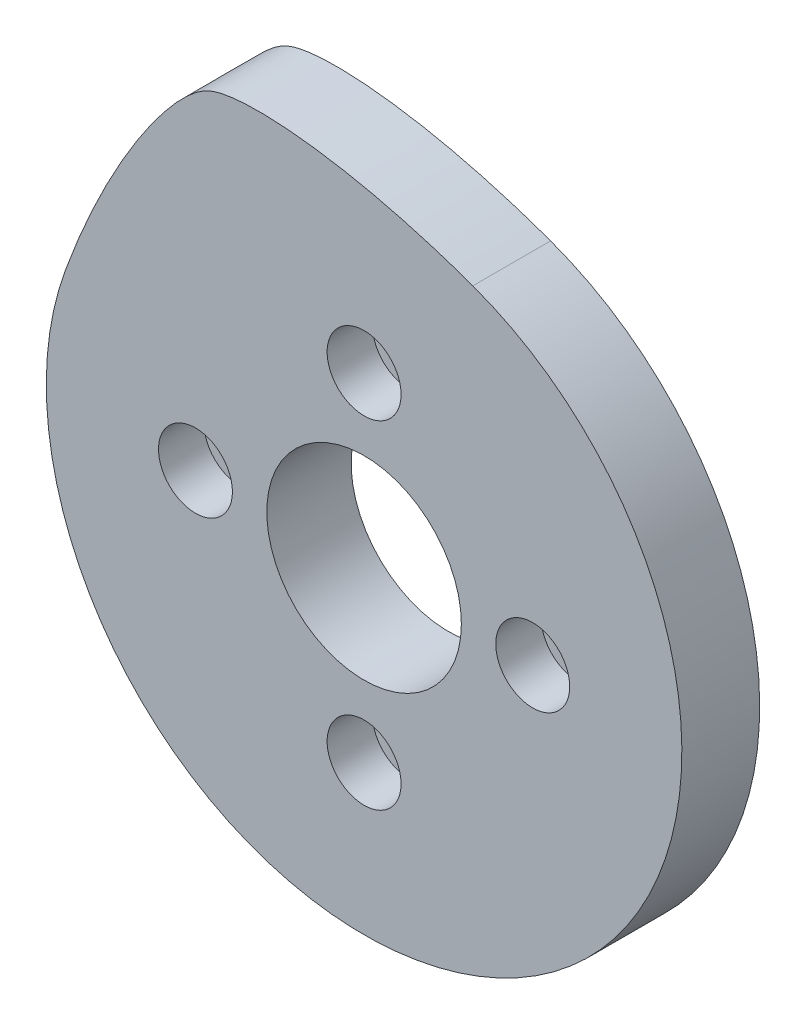
ISO-10303-21;
HEADER;
FILE_DESCRIPTION(('STEP AP214'),'2;1');
FILE_NAME('part.step','',(''),(''),'','','');
FILE_SCHEMA(('AUTOMOTIVE_DESIGN { 1 0 10303 214 1 1 1 1 }'));
ENDSEC;
DATA;
#1=APPLICATION_CONTEXT('core data for automotive mechanical design processes');
#2=APPLICATION_PROTOCOL_DEFINITION('international standard','automotive_design',2000,#1);
#3=PRODUCT_CONTEXT('',#1,'mechanical');
#4=PRODUCT('Part','Part','',(#3));
#5=PRODUCT_RELATED_PRODUCT_CATEGORY('part','',(#4));
#6=PRODUCT_DEFINITION_FORMATION('','',#4);
#7=PRODUCT_DEFINITION_CONTEXT('part definition',#1,'design');
#8=PRODUCT_DEFINITION('design','',#6,#7);
#9=PRODUCT_DEFINITION_SHAPE('','',#8);
#10=(LENGTH_UNIT() NAMED_UNIT(*) SI_UNIT(.MILLI.,.METRE.));
#11=(NAMED_UNIT(*) PLANE_ANGLE_UNIT() SI_UNIT($,.RADIAN.));
#12=(NAMED_UNIT(*) SI_UNIT($,.STERADIAN.) SOLID_ANGLE_UNIT());
#13=UNCERTAINTY_MEASURE_WITH_UNIT(LENGTH_MEASURE(1.E-05),#10,'distance_accuracy_value','');
#14=(GEOMETRIC_REPRESENTATION_CONTEXT(3) GLOBAL_UNCERTAINTY_ASSIGNED_CONTEXT((#13)) GLOBAL_UNIT_ASSIGNED_CONTEXT((#10,
#11,#12)) REPRESENTATION_CONTEXT('',''));
#15=CARTESIAN_POINT('',(0.,0.,0.));
#16=DIRECTION('',(0.,0.,1.));
#17=DIRECTION('',(1.,0.,0.));
#18=AXIS2_PLACEMENT_3D('',#15,#16,#17);
#19=CARTESIAN_POINT('',(-13.,0.,6.));
#20=DIRECTION('',(0.,0.,-1.));
#21=DIRECTION('',(-1.,0.,0.));
#22=AXIS2_PLACEMENT_3D('',#19,#20,#21);
#23=CYLINDRICAL_SURFACE('',#22,2.85);
#24=CARTESIAN_POINT('',(-13.,0.,2.5));
#25=DIRECTION('',(0.,0.,1.));
#26=DIRECTION('',(1.,0.,0.));
#27=AXIS2_PLACEMENT_3D('',#24,#25,#26);
#28=CIRCLE('',#27,2.85);
#29=CARTESIAN_POINT('',(-10.15,0.,2.5));
#30=VERTEX_POINT('',#29);
#31=EDGE_CURVE('E48',#30,#30,#28,.T.);
#32=ORIENTED_EDGE('',*,*,#31,.F.);
#33=EDGE_LOOP('',(#32));
#34=FACE_BOUND('',#33,.T.);
#35=CARTESIAN_POINT('',(-13.,0.,6.));
#36=DIRECTION('',(0.,0.,1.));
#37=DIRECTION('',(1.,0.,0.));
#38=AXIS2_PLACEMENT_3D('',#35,#36,#37);
#39=CIRCLE('',#38,2.85);
#40=CARTESIAN_POINT('',(-10.15,0.,6.));
#41=VERTEX_POINT('',#40);
#42=EDGE_CURVE('E104',#41,#41,#39,.T.);
#43=ORIENTED_EDGE('',*,*,#42,.T.);
#44=EDGE_LOOP('',(#43));
#45=FACE_BOUND('',#44,.T.);
#46=ADVANCED_FACE('F44',(#34,#45),#23,.F.);
#47=CARTESIAN_POINT('',(0.,13.,6.));
#48=DIRECTION('',(0.,0.,-1.));
#49=DIRECTION('',(-1.,0.,0.));
#50=AXIS2_PLACEMENT_3D('',#47,#48,#49);
#51=CYLINDRICAL_SURFACE('',#50,2.85);
#52=CARTESIAN_POINT('',(0.,13.,2.5));
#53=DIRECTION('',(0.,0.,1.));
#54=DIRECTION('',(1.,0.,0.));
#55=AXIS2_PLACEMENT_3D('',#52,#53,#54);
#56=CIRCLE('',#55,2.85);
#57=CARTESIAN_POINT('',(2.85000000000005,13.,2.5));
#58=VERTEX_POINT('',#57);
#59=EDGE_CURVE('E112',#58,#58,#56,.T.);
#60=ORIENTED_EDGE('',*,*,#59,.F.);
#61=EDGE_LOOP('',(#60));
#62=FACE_BOUND('',#61,.T.);
#63=CARTESIAN_POINT('',(0.,13.,6.));
#64=DIRECTION('',(0.,0.,1.));
#65=DIRECTION('',(1.,0.,0.));
#66=AXIS2_PLACEMENT_3D('',#63,#64,#65);
#67=CIRCLE('',#66,2.85);
#68=CARTESIAN_POINT('',(2.85000000000005,13.,6.));
#69=VERTEX_POINT('',#68);
#70=EDGE_CURVE('E101',#69,#69,#67,.T.);
#71=ORIENTED_EDGE('',*,*,#70,.T.);
#72=EDGE_LOOP('',(#71));
#73=FACE_BOUND('',#72,.T.);
#74=ADVANCED_FACE('F123',(#62,#73),#51,.F.);
#75=CARTESIAN_POINT('',(13.,0.,6.));
#76=DIRECTION('',(0.,0.,-1.));
#77=DIRECTION('',(-1.,0.,0.));
#78=AXIS2_PLACEMENT_3D('',#75,#76,#77);
#79=CYLINDRICAL_SURFACE('',#78,2.85);
#80=CARTESIAN_POINT('',(13.,0.,2.5));
#81=DIRECTION('',(0.,0.,1.));
#82=DIRECTION('',(1.,0.,0.));
#83=AXIS2_PLACEMENT_3D('',#80,#81,#82);
#84=CIRCLE('',#83,2.85);
#85=CARTESIAN_POINT('',(15.85,0.,2.5));
#86=VERTEX_POINT('',#85);
#87=EDGE_CURVE('E110',#86,#86,#84,.T.);
#88=ORIENTED_EDGE('',*,*,#87,.F.);
#89=EDGE_LOOP('',(#88));
#90=FACE_BOUND('',#89,.T.);
#91=CARTESIAN_POINT('',(13.,0.,6.));
#92=DIRECTION('',(0.,0.,1.));
#93=DIRECTION('',(1.,0.,0.));
#94=AXIS2_PLACEMENT_3D('',#91,#92,#93);
#95=CIRCLE('',#94,2.85);
#96=CARTESIAN_POINT('',(15.85,0.,6.));
#97=VERTEX_POINT('',#96);
#98=EDGE_CURVE('E98',#97,#97,#95,.T.);
#99=ORIENTED_EDGE('',*,*,#98,.T.);
#100=EDGE_LOOP('',(#99));
#101=FACE_BOUND('',#100,.T.);
#102=ADVANCED_FACE('F139',(#90,#101),#79,.F.);
#103=CARTESIAN_POINT('',(-1.36167772214882E-13,-13.,6.));
#104=DIRECTION('',(0.,0.,-1.));
#105=DIRECTION('',(-1.,0.,0.));
#106=AXIS2_PLACEMENT_3D('',#103,#104,#105);
#107=CYLINDRICAL_SURFACE('',#106,2.85);
#108=CARTESIAN_POINT('',(-1.36167772214882E-13,-13.,2.5));
#109=DIRECTION('',(0.,0.,1.));
#110=DIRECTION('',(1.,0.,0.));
#111=AXIS2_PLACEMENT_3D('',#108,#109,#110);
#112=CIRCLE('',#111,2.85);
#113=CARTESIAN_POINT('',(2.84999999999986,-13.,2.5));
#114=VERTEX_POINT('',#113);
#115=EDGE_CURVE('E107',#114,#114,#112,.T.);
#116=ORIENTED_EDGE('',*,*,#115,.F.);
#117=EDGE_LOOP('',(#116));
#118=FACE_BOUND('',#117,.T.);
#119=CARTESIAN_POINT('',(-1.36167772214882E-13,-13.,6.));
#120=DIRECTION('',(0.,0.,1.));
#121=DIRECTION('',(1.,0.,0.));
#122=AXIS2_PLACEMENT_3D('',#119,#120,#121);
#123=CIRCLE('',#122,2.85);
#124=CARTESIAN_POINT('',(2.84999999999986,-13.,6.));
#125=VERTEX_POINT('',#124);
#126=EDGE_CURVE('E75',#125,#125,#123,.T.);
#127=ORIENTED_EDGE('',*,*,#126,.T.);
#128=EDGE_LOOP('',(#127));
#129=FACE_BOUND('',#128,.T.);
#130=ADVANCED_FACE('F46',(#118,#129),#107,.F.);
#131=CARTESIAN_POINT('',(0.,0.,6.));
#132=DIRECTION('',(0.,0.,1.));
#133=DIRECTION('',(1.,0.,0.));
#134=AXIS2_PLACEMENT_3D('',#131,#132,#133);
#135=PLANE('',#134);
#136=CARTESIAN_POINT('',(0.,0.,6.));
#137=DIRECTION('',(0.,0.,1.));
#138=DIRECTION('',(1.,0.,0.));
#139=AXIS2_PLACEMENT_3D('',#136,#137,#138);
#140=CIRCLE('',#139,7.5);
#141=CARTESIAN_POINT('',(7.5,0.,6.));
#142=VERTEX_POINT('',#141);
#143=EDGE_CURVE('E221',#142,#142,#140,.T.);
#144=ORIENTED_EDGE('',*,*,#143,.F.);
#145=EDGE_LOOP('',(#144));
#146=FACE_BOUND('',#145,.T.);
#147=ORIENTED_EDGE('',*,*,#126,.F.);
#148=EDGE_LOOP('',(#147));
#149=FACE_BOUND('',#148,.T.);
#150=ORIENTED_EDGE('',*,*,#98,.F.);
#151=EDGE_LOOP('',(#150));
#152=FACE_BOUND('',#151,.T.);
#153=ORIENTED_EDGE('',*,*,#70,.F.);
#154=EDGE_LOOP('',(#153));
#155=FACE_BOUND('',#154,.T.);
#156=ORIENTED_EDGE('',*,*,#42,.F.);
#157=EDGE_LOOP('',(#156));
#158=FACE_BOUND('',#157,.T.);
#159=CARTESIAN_POINT('',(0.,0.,6.00000000000001));
#160=DIRECTION('',(0.,0.,1.));
#161=DIRECTION('',(1.,0.,0.));
#162=AXIS2_PLACEMENT_3D('',#159,#160,#161);
#163=CIRCLE('',#162,24.5);
#164=CARTESIAN_POINT('',(8.37949351147875,23.0224692092548,6.00000000000001));
#165=VERTEX_POINT('',#164);
#166=CARTESIAN_POINT('',(-23.0224692092548,8.37949351147867,6.00000000000001));
#167=VERTEX_POINT('',#166);
#168=EDGE_CURVE('E59',#165,#167,#163,.F.);
#169=ORIENTED_EDGE('',*,*,#168,.F.);
#170=CARTESIAN_POINT('',(-23.0224692092548,8.37949351147867,6.00000000000001));
#171=CARTESIAN_POINT('',(-19.9442879193239,16.8367270985519,6.00000000000001));
#172=CARTESIAN_POINT('',(-14.7236811956561,24.6247501376525,6.00000000000001));
#173=CARTESIAN_POINT('',(-9.3994531646,27.1074784422976,6.00000000000001));
#174=CARTESIAN_POINT('',(-0.0777400755944418,26.1006504991857,6.00000000000001));
#175=CARTESIAN_POINT('',(8.37949351147875,23.0224692092548,6.00000000000001));
#176=B_SPLINE_CURVE_WITH_KNOTS('',3,(#170,#171,#172,#173,#174,#175),.UNSPECIFIED.,.F.,.F.,(4,1,
1,4),(0.,0.45,0.55,1.),.UNSPECIFIED.);
#177=EDGE_CURVE('E72',#167,#165,#176,.T.);
#178=ORIENTED_EDGE('',*,*,#177,.F.);
#179=EDGE_LOOP('',(#169,#178));
#180=FACE_BOUND('',#179,.T.);
#181=ADVANCED_FACE('F73',(#146,#149,#152,#155,#158,#180),#135,.T.);
#182=CARTESIAN_POINT('',(0.,0.,0.));
#183=DIRECTION('',(0.,0.,1.));
#184=DIRECTION('',(1.,0.,0.));
#185=AXIS2_PLACEMENT_3D('',#182,#183,#184);
#186=PLANE('',#185);
#187=CARTESIAN_POINT('',(0.,0.,0.));
#188=DIRECTION('',(0.,0.,-1.));
#189=DIRECTION('',(-1.,0.,0.));
#190=AXIS2_PLACEMENT_3D('',#187,#188,#189);
#191=CIRCLE('',#190,21.);
#192=CARTESIAN_POINT('',(-21.,0.,0.));
#193=VERTEX_POINT('',#192);
#194=EDGE_CURVE('E12',#193,#193,#191,.T.);
#195=ORIENTED_EDGE('',*,*,#194,.F.);
#196=EDGE_LOOP('',(#195));
#197=FACE_BOUND('',#196,.T.);
#198=CARTESIAN_POINT('',(0.,0.,0.));
#199=DIRECTION('',(0.,0.,-1.));
#200=DIRECTION('',(-1.,0.,0.));
#201=AXIS2_PLACEMENT_3D('',#198,#199,#200);
#202=CIRCLE('',#201,24.5);
#203=CARTESIAN_POINT('',(8.37949351147875,23.0224692092548,0.));
#204=VERTEX_POINT('',#203);
#205=CARTESIAN_POINT('',(-23.0224692092548,8.37949351147867,0.));
#206=VERTEX_POINT('',#205);
#207=EDGE_CURVE('E81',#204,#206,#202,.T.);
#208=ORIENTED_EDGE('',*,*,#207,.T.);
#209=CARTESIAN_POINT('',(-23.0224692092548,8.37949351147867,0.));
#210=CARTESIAN_POINT('',(-19.9442879193239,16.8367270985519,0.));
#211=CARTESIAN_POINT('',(-14.7236811956561,24.6247501376525,0.));
#212=CARTESIAN_POINT('',(-9.3994531646,27.1074784422976,0.));
#213=CARTESIAN_POINT('',(-0.0777400755944418,26.1006504991857,0.));
#214=CARTESIAN_POINT('',(8.37949351147875,23.0224692092548,0.));
#215=B_SPLINE_CURVE_WITH_KNOTS('',3,(#209,#210,#211,#212,#213,#214),.UNSPECIFIED.,.F.,.F.,(4,1,
1,4),(0.,0.45,0.55,1.),.UNSPECIFIED.);
#216=EDGE_CURVE('E86',#206,#204,#215,.T.);
#217=ORIENTED_EDGE('',*,*,#216,.T.);
#218=EDGE_LOOP('',(#208,#217));
#219=FACE_BOUND('',#218,.T.);
#220=ADVANCED_FACE('F128',(#197,#219),#186,.F.);
#221=CARTESIAN_POINT('',(-23.0224692092548,8.37949351147867,77.1641189868336));
#222=CARTESIAN_POINT('',(-19.9442879193239,16.8367270985519,77.1641189868336));
#223=CARTESIAN_POINT('',(-14.7236811956561,24.6247501376525,77.1641189868336));
#224=CARTESIAN_POINT('',(-9.3994531646,27.1074784422976,77.1641189868336));
#225=CARTESIAN_POINT('',(-0.0777400755944418,26.1006504991857,77.1641189868336));
#226=CARTESIAN_POINT('',(8.37949351147875,23.0224692092548,77.1641189868336));
#227=B_SPLINE_CURVE_WITH_KNOTS('',3,(#221,#222,#223,#224,#225,#226),.UNSPECIFIED.,.F.,.F.,(4,1,
1,4),(0.,0.45,0.55,1.),.UNSPECIFIED.);
#228=DIRECTION('',(0.,0.,-1.));
#229=VECTOR('',#228,1.);
#230=SURFACE_OF_LINEAR_EXTRUSION('',#227,#229);
#231=DIRECTION('',(0.,0.,-1.));
#232=VECTOR('',#231,1.);
#233=CARTESIAN_POINT('',(-23.0224692092548,8.37949351147867,77.1641189868336));
#234=LINE('',#233,#232);
#235=EDGE_CURVE('E79',#167,#206,#234,.T.);
#236=ORIENTED_EDGE('',*,*,#235,.F.);
#237=ORIENTED_EDGE('',*,*,#177,.T.);
#238=DIRECTION('',(0.,0.,-1.));
#239=VECTOR('',#238,1.);
#240=CARTESIAN_POINT('',(8.37949351147875,23.0224692092548,77.1641189868336));
#241=LINE('',#240,#239);
#242=EDGE_CURVE('E66',#165,#204,#241,.T.);
#243=ORIENTED_EDGE('',*,*,#242,.T.);
#244=ORIENTED_EDGE('',*,*,#216,.F.);
#245=EDGE_LOOP('',(#236,#237,#243,#244));
#246=FACE_BOUND('',#245,.T.);
#247=ADVANCED_FACE('F84',(#246),#230,.T.);
#248=CARTESIAN_POINT('',(0.,0.,77.1641189868336));
#249=DIRECTION('',(0.,0.,-1.));
#250=DIRECTION('',(-1.,0.,0.));
#251=AXIS2_PLACEMENT_3D('',#248,#249,#250);
#252=CYLINDRICAL_SURFACE('',#251,24.5);
#253=ORIENTED_EDGE('',*,*,#242,.F.);
#254=ORIENTED_EDGE('',*,*,#168,.T.);
#255=ORIENTED_EDGE('',*,*,#235,.T.);
#256=ORIENTED_EDGE('',*,*,#207,.F.);
#257=EDGE_LOOP('',(#253,#254,#255,#256));
#258=FACE_BOUND('',#257,.T.);
#259=ADVANCED_FACE('F78',(#258),#252,.T.);
#260=CARTESIAN_POINT('',(13.,0.,14.0610173055266));
#261=DIRECTION('',(0.,0.,-1.));
#262=DIRECTION('',(-1.,0.,0.));
#263=AXIS2_PLACEMENT_3D('',#260,#261,#262);
#264=CYLINDRICAL_SURFACE('',#263,1.6);
#265=CARTESIAN_POINT('',(13.,0.,2.5));
#266=DIRECTION('',(0.,0.,1.));
#267=DIRECTION('',(1.,0.,0.));
#268=AXIS2_PLACEMENT_3D('',#265,#266,#267);
#269=CIRCLE('',#268,1.6);
#270=CARTESIAN_POINT('',(14.6,0.,2.5));
#271=VERTEX_POINT('',#270);
#272=EDGE_CURVE('E194',#271,#271,#269,.T.);
#273=ORIENTED_EDGE('',*,*,#272,.T.);
#274=EDGE_LOOP('',(#273));
#275=FACE_BOUND('',#274,.T.);
#276=CARTESIAN_POINT('',(13.,0.,-0.5));
#277=DIRECTION('',(0.,0.,-1.));
#278=DIRECTION('',(-1.,0.,0.));
#279=AXIS2_PLACEMENT_3D('',#276,#277,#278);
#280=CIRCLE('',#279,1.6);
#281=CARTESIAN_POINT('',(11.4,0.,-0.5));
#282=VERTEX_POINT('',#281);
#283=EDGE_CURVE('E208',#282,#282,#280,.T.);
#284=ORIENTED_EDGE('',*,*,#283,.T.);
#285=EDGE_LOOP('',(#284));
#286=FACE_BOUND('',#285,.T.);
#287=ADVANCED_FACE('F163',(#275,#286),#264,.F.);
#288=CARTESIAN_POINT('',(0.,0.,2.5));
#289=DIRECTION('',(0.,0.,1.));
#290=DIRECTION('',(1.,0.,0.));
#291=AXIS2_PLACEMENT_3D('',#288,#289,#290);
#292=PLANE('',#291);
#293=ORIENTED_EDGE('',*,*,#272,.F.);
#294=EDGE_LOOP('',(#293));
#295=FACE_BOUND('',#294,.T.);
#296=ORIENTED_EDGE('',*,*,#87,.T.);
#297=EDGE_LOOP('',(#296));
#298=FACE_BOUND('',#297,.T.);
#299=ADVANCED_FACE('F160',(#295,#298),#292,.T.);
#300=CARTESIAN_POINT('',(0.,13.,14.0610173055266));
#301=DIRECTION('',(0.,0.,-1.));
#302=DIRECTION('',(-1.,0.,0.));
#303=AXIS2_PLACEMENT_3D('',#300,#301,#302);
#304=CYLINDRICAL_SURFACE('',#303,1.6);
#305=CARTESIAN_POINT('',(0.,13.,2.5));
#306=DIRECTION('',(0.,0.,1.));
#307=DIRECTION('',(1.,0.,0.));
#308=AXIS2_PLACEMENT_3D('',#305,#306,#307);
#309=CIRCLE('',#308,1.6);
#310=CARTESIAN_POINT('',(1.60000000000005,13.,2.5));
#311=VERTEX_POINT('',#310);
#312=EDGE_CURVE('E197',#311,#311,#309,.T.);
#313=ORIENTED_EDGE('',*,*,#312,.T.);
#314=EDGE_LOOP('',(#313));
#315=FACE_BOUND('',#314,.T.);
#316=CARTESIAN_POINT('',(0.,13.,-0.5));
#317=DIRECTION('',(0.,0.,-1.));
#318=DIRECTION('',(-1.,0.,0.));
#319=AXIS2_PLACEMENT_3D('',#316,#317,#318);
#320=CIRCLE('',#319,1.6);
#321=CARTESIAN_POINT('',(-1.59999999999996,13.,-0.5));
#322=VERTEX_POINT('',#321);
#323=EDGE_CURVE('E217',#322,#322,#320,.T.);
#324=ORIENTED_EDGE('',*,*,#323,.T.);
#325=EDGE_LOOP('',(#324));
#326=FACE_BOUND('',#325,.T.);
#327=ADVANCED_FACE('F162',(#315,#326),#304,.F.);
#328=CARTESIAN_POINT('',(0.,0.,2.5));
#329=DIRECTION('',(0.,0.,1.));
#330=DIRECTION('',(1.,0.,0.));
#331=AXIS2_PLACEMENT_3D('',#328,#329,#330);
#332=PLANE('',#331);
#333=ORIENTED_EDGE('',*,*,#312,.F.);
#334=EDGE_LOOP('',(#333));
#335=FACE_BOUND('',#334,.T.);
#336=ORIENTED_EDGE('',*,*,#59,.T.);
#337=EDGE_LOOP('',(#336));
#338=FACE_BOUND('',#337,.T.);
#339=ADVANCED_FACE('F170',(#335,#338),#332,.T.);
#340=CARTESIAN_POINT('',(-13.,0.,14.0610173055266));
#341=DIRECTION('',(0.,0.,-1.));
#342=DIRECTION('',(-1.,0.,0.));
#343=AXIS2_PLACEMENT_3D('',#340,#341,#342);
#344=CYLINDRICAL_SURFACE('',#343,1.6);
#345=CARTESIAN_POINT('',(-13.,0.,2.5));
#346=DIRECTION('',(0.,0.,1.));
#347=DIRECTION('',(1.,0.,0.));
#348=AXIS2_PLACEMENT_3D('',#345,#346,#347);
#349=CIRCLE('',#348,1.6);
#350=CARTESIAN_POINT('',(-11.4,0.,2.5));
#351=VERTEX_POINT('',#350);
#352=EDGE_CURVE('E201',#351,#351,#349,.T.);
#353=ORIENTED_EDGE('',*,*,#352,.T.);
#354=EDGE_LOOP('',(#353));
#355=FACE_BOUND('',#354,.T.);
#356=CARTESIAN_POINT('',(-13.,0.,-0.5));
#357=DIRECTION('',(0.,0.,-1.));
#358=DIRECTION('',(-1.,0.,0.));
#359=AXIS2_PLACEMENT_3D('',#356,#357,#358);
#360=CIRCLE('',#359,1.6);
#361=CARTESIAN_POINT('',(-14.6,0.,-0.5));
#362=VERTEX_POINT('',#361);
#363=EDGE_CURVE('E214',#362,#362,#360,.T.);
#364=ORIENTED_EDGE('',*,*,#363,.T.);
#365=EDGE_LOOP('',(#364));
#366=FACE_BOUND('',#365,.T.);
#367=ADVANCED_FACE('F249',(#355,#366),#344,.F.);
#368=CARTESIAN_POINT('',(0.,0.,2.5));
#369=DIRECTION('',(0.,0.,1.));
#370=DIRECTION('',(1.,0.,0.));
#371=AXIS2_PLACEMENT_3D('',#368,#369,#370);
#372=PLANE('',#371);
#373=ORIENTED_EDGE('',*,*,#352,.F.);
#374=EDGE_LOOP('',(#373));
#375=FACE_BOUND('',#374,.T.);
#376=ORIENTED_EDGE('',*,*,#31,.T.);
#377=EDGE_LOOP('',(#376));
#378=FACE_BOUND('',#377,.T.);
#379=ADVANCED_FACE('F119',(#375,#378),#372,.T.);
#380=CARTESIAN_POINT('',(-1.36167772214882E-13,-13.,14.0610173055266));
#381=DIRECTION('',(0.,0.,-1.));
#382=DIRECTION('',(-1.,0.,0.));
#383=AXIS2_PLACEMENT_3D('',#380,#381,#382);
#384=CYLINDRICAL_SURFACE('',#383,1.6);
#385=CARTESIAN_POINT('',(-1.36167772214882E-13,-13.,2.5));
#386=DIRECTION('',(0.,0.,1.));
#387=DIRECTION('',(1.,0.,0.));
#388=AXIS2_PLACEMENT_3D('',#385,#386,#387);
#389=CIRCLE('',#388,1.6);
#390=CARTESIAN_POINT('',(1.59999999999986,-13.,2.5));
#391=VERTEX_POINT('',#390);
#392=EDGE_CURVE('E82',#391,#391,#389,.T.);
#393=ORIENTED_EDGE('',*,*,#392,.T.);
#394=EDGE_LOOP('',(#393));
#395=FACE_BOUND('',#394,.T.);
#396=CARTESIAN_POINT('',(-1.36167772214882E-13,-13.,-0.5));
#397=DIRECTION('',(0.,0.,-1.));
#398=DIRECTION('',(-1.,0.,0.));
#399=AXIS2_PLACEMENT_3D('',#396,#397,#398);
#400=CIRCLE('',#399,1.6);
#401=CARTESIAN_POINT('',(-1.60000000000014,-13.,-0.5));
#402=VERTEX_POINT('',#401);
#403=EDGE_CURVE('E211',#402,#402,#400,.T.);
#404=ORIENTED_EDGE('',*,*,#403,.T.);
#405=EDGE_LOOP('',(#404));
#406=FACE_BOUND('',#405,.T.);
#407=ADVANCED_FACE('F242',(#395,#406),#384,.F.);
#408=CARTESIAN_POINT('',(0.,0.,2.5));
#409=DIRECTION('',(0.,0.,1.));
#410=DIRECTION('',(1.,0.,0.));
#411=AXIS2_PLACEMENT_3D('',#408,#409,#410);
#412=PLANE('',#411);
#413=ORIENTED_EDGE('',*,*,#392,.F.);
#414=EDGE_LOOP('',(#413));
#415=FACE_BOUND('',#414,.T.);
#416=ORIENTED_EDGE('',*,*,#115,.T.);
#417=EDGE_LOOP('',(#416));
#418=FACE_BOUND('',#417,.T.);
#419=ADVANCED_FACE('F240',(#415,#418),#412,.T.);
#420=CARTESIAN_POINT('',(0.,0.,-0.5));
#421=DIRECTION('',(0.,0.,-1.));
#422=DIRECTION('',(-1.,0.,0.));
#423=AXIS2_PLACEMENT_3D('',#420,#421,#422);
#424=PLANE('',#423);
#425=CARTESIAN_POINT('',(0.,0.,-0.5));
#426=DIRECTION('',(0.,0.,1.));
#427=DIRECTION('',(1.,0.,0.));
#428=AXIS2_PLACEMENT_3D('',#425,#426,#427);
#429=CIRCLE('',#428,7.5);
#430=CARTESIAN_POINT('',(7.5,0.,-0.5));
#431=VERTEX_POINT('',#430);
#432=EDGE_CURVE('E220',#431,#431,#429,.T.);
#433=ORIENTED_EDGE('',*,*,#432,.T.);
#434=EDGE_LOOP('',(#433));
#435=FACE_BOUND('',#434,.T.);
#436=ORIENTED_EDGE('',*,*,#363,.F.);
#437=EDGE_LOOP('',(#436));
#438=FACE_BOUND('',#437,.T.);
#439=ORIENTED_EDGE('',*,*,#283,.F.);
#440=EDGE_LOOP('',(#439));
#441=FACE_BOUND('',#440,.T.);
#442=CARTESIAN_POINT('',(0.,0.,-0.5));
#443=DIRECTION('',(0.,0.,-1.));
#444=DIRECTION('',(-1.,0.,0.));
#445=AXIS2_PLACEMENT_3D('',#442,#443,#444);
#446=CIRCLE('',#445,21.);
#447=CARTESIAN_POINT('',(-21.,0.,-0.5));
#448=VERTEX_POINT('',#447);
#449=EDGE_CURVE('E198',#448,#448,#446,.T.);
#450=ORIENTED_EDGE('',*,*,#449,.T.);
#451=EDGE_LOOP('',(#450));
#452=FACE_BOUND('',#451,.T.);
#453=ORIENTED_EDGE('',*,*,#403,.F.);
#454=EDGE_LOOP('',(#453));
#455=FACE_BOUND('',#454,.T.);
#456=ORIENTED_EDGE('',*,*,#323,.F.);
#457=EDGE_LOOP('',(#456));
#458=FACE_BOUND('',#457,.T.);
#459=ADVANCED_FACE('F227',(#435,#438,#441,#452,#455,#458),#424,.T.);
#460=CARTESIAN_POINT('',(0.,0.,-0.5));
#461=DIRECTION('',(0.,0.,1.));
#462=DIRECTION('',(1.,0.,0.));
#463=AXIS2_PLACEMENT_3D('',#460,#461,#462);
#464=CYLINDRICAL_SURFACE('',#463,21.);
#465=ORIENTED_EDGE('',*,*,#449,.F.);
#466=EDGE_LOOP('',(#465));
#467=FACE_BOUND('',#466,.T.);
#468=ORIENTED_EDGE('',*,*,#194,.T.);
#469=EDGE_LOOP('',(#468));
#470=FACE_BOUND('',#469,.T.);
#471=ADVANCED_FACE('F233',(#467,#470),#464,.T.);
#472=CARTESIAN_POINT('',(0.,0.,-0.5));
#473=DIRECTION('',(0.,0.,1.));
#474=DIRECTION('',(1.,0.,0.));
#475=AXIS2_PLACEMENT_3D('',#472,#473,#474);
#476=CYLINDRICAL_SURFACE('',#475,7.5);
#477=ORIENTED_EDGE('',*,*,#432,.F.);
#478=EDGE_LOOP('',(#477));
#479=FACE_BOUND('',#478,.T.);
#480=ORIENTED_EDGE('',*,*,#143,.T.);
#481=EDGE_LOOP('',(#480));
#482=FACE_BOUND('',#481,.T.);
#483=ADVANCED_FACE('F230',(#479,#482),#476,.F.);
#484=CLOSED_SHELL('',(#46,#74,#102,#130,#181,#220,#247,#259,#287,#299,#327,#339,#367,#379,#407,
#419,#459,#471,#483));
#485=MANIFOLD_SOLID_BREP('B2',#484);
#486=ADVANCED_BREP_SHAPE_REPRESENTATION('',(#18,#485),#14);
#487=SHAPE_DEFINITION_REPRESENTATION(#9,#486);
ENDSEC;
END-ISO-10303-21;
